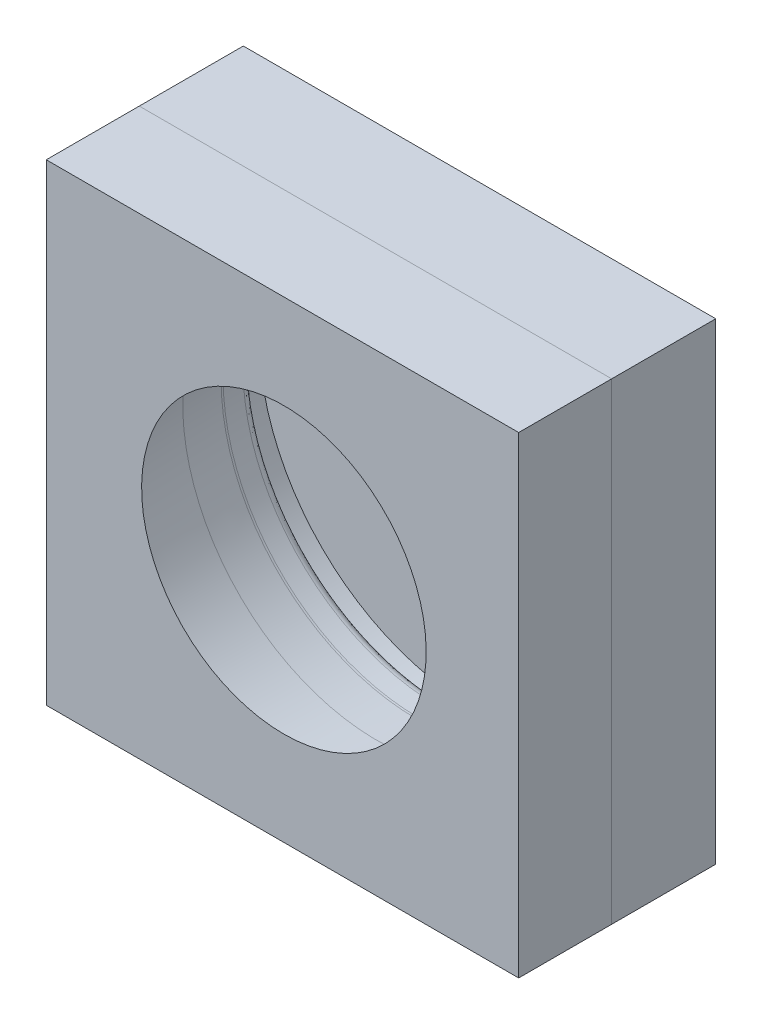
ISO-10303-21;
HEADER;
FILE_DESCRIPTION(('STEP AP214'),'2;1');
FILE_NAME('part.step','',(''),(''),'','','');
FILE_SCHEMA(('AUTOMOTIVE_DESIGN { 1 0 10303 214 1 1 1 1 }'));
ENDSEC;
DATA;
#1=APPLICATION_CONTEXT('core data for automotive mechanical design processes');
#2=APPLICATION_PROTOCOL_DEFINITION('international standard','automotive_design',2000,#1);
#3=PRODUCT_CONTEXT('',#1,'mechanical');
#4=PRODUCT('Part','Part','',(#3));
#5=PRODUCT_RELATED_PRODUCT_CATEGORY('part','',(#4));
#6=PRODUCT_DEFINITION_FORMATION('','',#4);
#7=PRODUCT_DEFINITION_CONTEXT('part definition',#1,'design');
#8=PRODUCT_DEFINITION('design','',#6,#7);
#9=PRODUCT_DEFINITION_SHAPE('','',#8);
#10=(LENGTH_UNIT() NAMED_UNIT(*) SI_UNIT(.MILLI.,.METRE.));
#11=(NAMED_UNIT(*) PLANE_ANGLE_UNIT() SI_UNIT($,.RADIAN.));
#12=(NAMED_UNIT(*) SI_UNIT($,.STERADIAN.) SOLID_ANGLE_UNIT());
#13=UNCERTAINTY_MEASURE_WITH_UNIT(LENGTH_MEASURE(1.E-05),#10,'distance_accuracy_value','');
#14=(GEOMETRIC_REPRESENTATION_CONTEXT(3) GLOBAL_UNCERTAINTY_ASSIGNED_CONTEXT((#13)) GLOBAL_UNIT_ASSIGNED_CONTEXT((#10,
#11,#12)) REPRESENTATION_CONTEXT('',''));
#15=CARTESIAN_POINT('',(0.,0.,0.));
#16=DIRECTION('',(0.,0.,1.));
#17=DIRECTION('',(1.,0.,0.));
#18=AXIS2_PLACEMENT_3D('',#15,#16,#17);
#19=CARTESIAN_POINT('',(0.,-2.43573640629004E-13,67.1329433698925));
#20=DIRECTION('',(0.,0.,1.));
#21=DIRECTION('',(1.,0.,0.));
#22=AXIS2_PLACEMENT_3D('',#19,#20,#21);
#23=PLANE('',#22);
#24=DIRECTION('',(0.,-1.,0.));
#25=VECTOR('',#24,1.);
#26=CARTESIAN_POINT('',(-152.4,152.4,67.1329433698925));
#27=LINE('',#26,#25);
#28=CARTESIAN_POINT('',(-152.4,152.4,67.1329433698925));
#29=VERTEX_POINT('',#28);
#30=CARTESIAN_POINT('',(-152.4,-152.4,67.1329433698925));
#31=VERTEX_POINT('',#30);
#32=EDGE_CURVE('E99',#29,#31,#27,.T.);
#33=ORIENTED_EDGE('',*,*,#32,.T.);
#34=DIRECTION('',(1.,0.,0.));
#35=VECTOR('',#34,1.);
#36=CARTESIAN_POINT('',(152.4,-152.4,67.1329433698925));
#37=LINE('',#36,#35);
#38=CARTESIAN_POINT('',(152.4,-152.4,67.1329433698925));
#39=VERTEX_POINT('',#38);
#40=EDGE_CURVE('E201',#31,#39,#37,.T.);
#41=ORIENTED_EDGE('',*,*,#40,.T.);
#42=DIRECTION('',(0.,1.,0.));
#43=VECTOR('',#42,1.);
#44=CARTESIAN_POINT('',(152.4,152.4,67.1329433698925));
#45=LINE('',#44,#43);
#46=CARTESIAN_POINT('',(152.4,152.4,67.1329433698925));
#47=VERTEX_POINT('',#46);
#48=EDGE_CURVE('E103',#39,#47,#45,.T.);
#49=ORIENTED_EDGE('',*,*,#48,.T.);
#50=DIRECTION('',(-1.,0.,0.));
#51=VECTOR('',#50,1.);
#52=CARTESIAN_POINT('',(152.4,152.4,67.1329433698925));
#53=LINE('',#52,#51);
#54=EDGE_CURVE('E91',#47,#29,#53,.T.);
#55=ORIENTED_EDGE('',*,*,#54,.T.);
#56=EDGE_LOOP('',(#33,#41,#49,#55));
#57=FACE_BOUND('',#56,.T.);
#58=CARTESIAN_POINT('',(0.908695261639877,-0.0776127525779172,67.1329433698925));
#59=DIRECTION('',(0.,0.,1.));
#60=DIRECTION('',(1.,0.,0.));
#61=AXIS2_PLACEMENT_3D('',#58,#59,#60);
#62=CIRCLE('',#61,125.28603319766);
#63=CARTESIAN_POINT('',(126.1947284593,-0.0776127525779172,67.1329433698925));
#64=VERTEX_POINT('',#63);
#65=EDGE_CURVE('E111',#64,#64,#62,.T.);
#66=ORIENTED_EDGE('',*,*,#65,.F.);
#67=EDGE_LOOP('',(#66));
#68=FACE_BOUND('',#67,.T.);
#69=ADVANCED_FACE('F45',(#57,#68),#23,.T.);
#70=CARTESIAN_POINT('',(152.4,-152.4,228.6));
#71=DIRECTION('',(0.,1.,0.));
#72=DIRECTION('',(-1.,0.,0.));
#73=AXIS2_PLACEMENT_3D('',#70,#71,#72);
#74=PLANE('',#73);
#75=ORIENTED_EDGE('',*,*,#40,.F.);
#76=DIRECTION('',(0.,0.,-1.));
#77=VECTOR('',#76,1.);
#78=CARTESIAN_POINT('',(-152.4,-152.4,228.6));
#79=LINE('',#78,#77);
#80=CARTESIAN_POINT('',(-152.4,-152.4,0.));
#81=VERTEX_POINT('',#80);
#82=EDGE_CURVE('E62',#31,#81,#79,.T.);
#83=ORIENTED_EDGE('',*,*,#82,.T.);
#84=DIRECTION('',(1.,0.,0.));
#85=VECTOR('',#84,1.);
#86=CARTESIAN_POINT('',(152.4,-152.4,0.));
#87=LINE('',#86,#85);
#88=CARTESIAN_POINT('',(152.4,-152.4,0.));
#89=VERTEX_POINT('',#88);
#90=EDGE_CURVE('E116',#81,#89,#87,.T.);
#91=ORIENTED_EDGE('',*,*,#90,.T.);
#92=DIRECTION('',(0.,0.,-1.));
#93=VECTOR('',#92,1.);
#94=CARTESIAN_POINT('',(152.4,-152.4,228.6));
#95=LINE('',#94,#93);
#96=EDGE_CURVE('E70',#39,#89,#95,.T.);
#97=ORIENTED_EDGE('',*,*,#96,.F.);
#98=EDGE_LOOP('',(#75,#83,#91,#97));
#99=FACE_BOUND('',#98,.T.);
#100=ADVANCED_FACE('F172',(#99),#74,.F.);
#101=CARTESIAN_POINT('',(-152.4,152.4,228.6));
#102=DIRECTION('',(1.,0.,0.));
#103=DIRECTION('',(0.,1.,0.));
#104=AXIS2_PLACEMENT_3D('',#101,#102,#103);
#105=PLANE('',#104);
#106=ORIENTED_EDGE('',*,*,#32,.F.);
#107=DIRECTION('',(0.,0.,-1.));
#108=VECTOR('',#107,1.);
#109=CARTESIAN_POINT('',(-152.4,152.4,228.6));
#110=LINE('',#109,#108);
#111=CARTESIAN_POINT('',(-152.4,152.4,0.));
#112=VERTEX_POINT('',#111);
#113=EDGE_CURVE('E49',#29,#112,#110,.T.);
#114=ORIENTED_EDGE('',*,*,#113,.T.);
#115=DIRECTION('',(0.,-1.,0.));
#116=VECTOR('',#115,1.);
#117=CARTESIAN_POINT('',(-152.4,152.4,0.));
#118=LINE('',#117,#116);
#119=EDGE_CURVE('E119',#112,#81,#118,.T.);
#120=ORIENTED_EDGE('',*,*,#119,.T.);
#121=ORIENTED_EDGE('',*,*,#82,.F.);
#122=EDGE_LOOP('',(#106,#114,#120,#121));
#123=FACE_BOUND('',#122,.T.);
#124=ADVANCED_FACE('F100',(#123),#105,.F.);
#125=CARTESIAN_POINT('',(0.,0.,0.));
#126=DIRECTION('',(0.,0.,-1.));
#127=DIRECTION('',(-1.,0.,0.));
#128=AXIS2_PLACEMENT_3D('',#125,#126,#127);
#129=PLANE('',#128);
#130=ORIENTED_EDGE('',*,*,#119,.F.);
#131=DIRECTION('',(-1.,0.,0.));
#132=VECTOR('',#131,1.);
#133=CARTESIAN_POINT('',(152.4,152.4,0.));
#134=LINE('',#133,#132);
#135=CARTESIAN_POINT('',(152.4,152.4,0.));
#136=VERTEX_POINT('',#135);
#137=EDGE_CURVE('E93',#136,#112,#134,.T.);
#138=ORIENTED_EDGE('',*,*,#137,.F.);
#139=DIRECTION('',(0.,1.,0.));
#140=VECTOR('',#139,1.);
#141=CARTESIAN_POINT('',(152.4,152.4,0.));
#142=LINE('',#141,#140);
#143=EDGE_CURVE('E113',#89,#136,#142,.T.);
#144=ORIENTED_EDGE('',*,*,#143,.F.);
#145=ORIENTED_EDGE('',*,*,#90,.F.);
#146=EDGE_LOOP('',(#130,#138,#144,#145));
#147=FACE_BOUND('',#146,.T.);
#148=ADVANCED_FACE('F118',(#147),#129,.T.);
#149=CARTESIAN_POINT('',(152.4,152.4,228.6));
#150=DIRECTION('',(-1.,0.,0.));
#151=DIRECTION('',(0.,-1.,0.));
#152=AXIS2_PLACEMENT_3D('',#149,#150,#151);
#153=PLANE('',#152);
#154=ORIENTED_EDGE('',*,*,#48,.F.);
#155=ORIENTED_EDGE('',*,*,#96,.T.);
#156=ORIENTED_EDGE('',*,*,#143,.T.);
#157=DIRECTION('',(0.,0.,-1.));
#158=VECTOR('',#157,1.);
#159=CARTESIAN_POINT('',(152.4,152.4,228.6));
#160=LINE('',#159,#158);
#161=EDGE_CURVE('E97',#47,#136,#160,.T.);
#162=ORIENTED_EDGE('',*,*,#161,.F.);
#163=EDGE_LOOP('',(#154,#155,#156,#162));
#164=FACE_BOUND('',#163,.T.);
#165=ADVANCED_FACE('F114',(#164),#153,.F.);
#166=CARTESIAN_POINT('',(152.4,152.4,228.6));
#167=DIRECTION('',(0.,-1.,0.));
#168=DIRECTION('',(1.,0.,0.));
#169=AXIS2_PLACEMENT_3D('',#166,#167,#168);
#170=PLANE('',#169);
#171=ORIENTED_EDGE('',*,*,#54,.F.);
#172=ORIENTED_EDGE('',*,*,#161,.T.);
#173=ORIENTED_EDGE('',*,*,#137,.T.);
#174=ORIENTED_EDGE('',*,*,#113,.F.);
#175=EDGE_LOOP('',(#171,#172,#173,#174));
#176=FACE_BOUND('',#175,.T.);
#177=ADVANCED_FACE('F47',(#176),#170,.F.);
#178=CARTESIAN_POINT('',(0.90869526163995,-0.0776127525779172,41.3463400319306));
#179=DIRECTION('',(0.,0.,-1.));
#180=DIRECTION('',(0.,1.,0.));
#181=AXIS2_PLACEMENT_3D('',#178,#179,#180);
#182=CONICAL_SURFACE('',#181,126.276654574374,0.0383972435438753);
#183=CARTESIAN_POINT('',(0.90869526163995,-0.0776127525779172,41.3463400319306));
#184=DIRECTION('',(0.,0.,1.));
#185=DIRECTION('',(0.,-1.,0.));
#186=AXIS2_PLACEMENT_3D('',#183,#184,#185);
#187=CIRCLE('',#186,126.276654574374);
#188=CARTESIAN_POINT('',(0.90869526163995,-126.354267326952,41.3463400319301));
#189=VERTEX_POINT('',#188);
#190=EDGE_CURVE('E124',#189,#189,#187,.T.);
#191=ORIENTED_EDGE('',*,*,#190,.F.);
#192=EDGE_LOOP('',(#191));
#193=FACE_BOUND('',#192,.T.);
#194=ORIENTED_EDGE('',*,*,#65,.T.);
#195=EDGE_LOOP('',(#194));
#196=FACE_BOUND('',#195,.T.);
#197=ADVANCED_FACE('F169',(#193,#196),#182,.F.);
#198=CARTESIAN_POINT('',(0.90869526163995,-0.0776127525779125,40.0027667138672));
#199=DIRECTION('',(0.,0.,1.));
#200=DIRECTION('',(0.,-1.,0.));
#201=AXIS2_PLACEMENT_3D('',#198,#199,#200);
#202=TOROIDAL_SURFACE('',#201,91.302452500002,35.);
#203=ORIENTED_EDGE('',*,*,#190,.T.);
#204=EDGE_LOOP('',(#203));
#205=FACE_BOUND('',#204,.T.);
#206=CARTESIAN_POINT('',(0.90869526163995,-0.0776127525779125,40.0027667138671));
#207=DIRECTION('',(0.,0.,1.));
#208=DIRECTION('',(0.,-1.,0.));
#209=AXIS2_PLACEMENT_3D('',#206,#207,#208);
#210=CIRCLE('',#209,126.302452500002);
#211=CARTESIAN_POINT('',(0.90869526163995,-126.38006525258,40.0027667138667));
#212=VERTEX_POINT('',#211);
#213=EDGE_CURVE('E127',#212,#212,#210,.T.);
#214=ORIENTED_EDGE('',*,*,#213,.F.);
#215=EDGE_LOOP('',(#214));
#216=FACE_BOUND('',#215,.T.);
#217=ADVANCED_FACE('F173',(#205,#216),#202,.F.);
#218=CARTESIAN_POINT('',(0.90869526163995,-0.0776127525783632,169.085651996013));
#219=DIRECTION('',(0.,0.,1.));
#220=DIRECTION('',(0.,-1.,0.));
#221=AXIS2_PLACEMENT_3D('',#218,#219,#220);
#222=CYLINDRICAL_SURFACE('',#221,126.302452500002);
#223=CARTESIAN_POINT('',(0.90869526163995,-0.0776127525778679,27.2484054174911));
#224=DIRECTION('',(0.,0.,1.));
#225=DIRECTION('',(0.,-1.,0.));
#226=AXIS2_PLACEMENT_3D('',#223,#224,#225);
#227=CIRCLE('',#226,126.302452500002);
#228=CARTESIAN_POINT('',(0.90869526163995,-126.38006525258,27.2484054174907));
#229=VERTEX_POINT('',#228);
#230=EDGE_CURVE('E130',#229,#229,#227,.T.);
#231=ORIENTED_EDGE('',*,*,#230,.F.);
#232=EDGE_LOOP('',(#231));
#233=FACE_BOUND('',#232,.T.);
#234=ORIENTED_EDGE('',*,*,#213,.T.);
#235=EDGE_LOOP('',(#234));
#236=FACE_BOUND('',#235,.T.);
#237=ADVANCED_FACE('F155',(#233,#236),#222,.F.);
#238=CARTESIAN_POINT('',(0.90869526163995,-133.59734825258,20.9609433698914));
#239=CARTESIAN_POINT('',(0.90869526163995,-128.912310640584,20.2965209052261));
#240=CARTESIAN_POINT('',(0.90869526163995,-126.38006525258,23.7261671924004));
#241=CARTESIAN_POINT('',(0.90869526163995,-126.38006525258,27.2484054174907));
#242=(BOUNDED_CURVE() B_SPLINE_CURVE(3,(#238,#239,#240,#241),.UNSPECIFIED.,.F.,
.F.) B_SPLINE_CURVE_WITH_KNOTS((4,4),(0.,1.),
.UNSPECIFIED.) CURVE() GEOMETRIC_REPRESENTATION_ITEM() RATIONAL_B_SPLINE_CURVE((0.255591691964593,
0.242825015050018,0.327183181081988,0.508666190060503)) REPRESENTATION_ITEM(''));
#243=CARTESIAN_POINT('',(0.90869526163995,-0.0776127525783632,169.085651996013));
#244=DIRECTION('',(0.,0.,1.));
#245=AXIS1_PLACEMENT('',#243,#244);
#246=SURFACE_OF_REVOLUTION('',#242,#245);
#247=ORIENTED_EDGE('',*,*,#230,.T.);
#248=EDGE_LOOP('',(#247));
#249=FACE_BOUND('',#248,.T.);
#250=CARTESIAN_POINT('',(0.90869526163995,-0.077612752577846,20.9609433698918));
#251=DIRECTION('',(0.,0.,1.));
#252=DIRECTION('',(0.,-1.,0.));
#253=AXIS2_PLACEMENT_3D('',#250,#251,#252);
#254=CIRCLE('',#253,133.519735500002);
#255=CARTESIAN_POINT('',(0.90869526163995,-133.59734825258,20.9609433698914));
#256=VERTEX_POINT('',#255);
#257=EDGE_CURVE('E133',#256,#256,#254,.T.);
#258=ORIENTED_EDGE('',*,*,#257,.F.);
#259=EDGE_LOOP('',(#258));
#260=FACE_BOUND('',#259,.T.);
#261=ADVANCED_FACE('F150',(#249,#260),#246,.F.);
#262=CARTESIAN_POINT('',(0.90869526163995,-133.59734825258,20.9609433698914));
#263=CARTESIAN_POINT('',(0.90869526163995,-136.783173828737,21.4127506458637));
#264=CARTESIAN_POINT('',(0.90869526163995,-138.50510069258,19.0805911705852));
#265=CARTESIAN_POINT('',(0.90869526163995,-138.50510069258,16.685469177524));
#266=(BOUNDED_CURVE() B_SPLINE_CURVE(3,(#262,#263,#264,#265),.UNSPECIFIED.,.F.,
.F.) B_SPLINE_CURVE_WITH_KNOTS((4,4),(0.,1.),
.UNSPECIFIED.) CURVE() GEOMETRIC_REPRESENTATION_ITEM() RATIONAL_B_SPLINE_CURVE((0.255591691964592,
0.242825015050017,0.327183181081988,0.508666190060503)) REPRESENTATION_ITEM(''));
#267=CARTESIAN_POINT('',(0.90869526163995,-0.0776127525783632,169.085651996013));
#268=DIRECTION('',(0.,0.,1.));
#269=AXIS1_PLACEMENT('',#267,#268);
#270=SURFACE_OF_REVOLUTION('',#266,#269);
#271=CARTESIAN_POINT('',(0.90869526163995,-0.0776127525778311,16.6854691775245));
#272=DIRECTION('',(0.,0.,1.));
#273=DIRECTION('',(0.,-1.,0.));
#274=AXIS2_PLACEMENT_3D('',#271,#272,#273);
#275=CIRCLE('',#274,138.427487940002);
#276=CARTESIAN_POINT('',(0.90869526163995,-138.50510069258,16.685469177524));
#277=VERTEX_POINT('',#276);
#278=EDGE_CURVE('E54',#277,#277,#275,.T.);
#279=ORIENTED_EDGE('',*,*,#278,.F.);
#280=EDGE_LOOP('',(#279));
#281=FACE_BOUND('',#280,.T.);
#282=ORIENTED_EDGE('',*,*,#257,.T.);
#283=EDGE_LOOP('',(#282));
#284=FACE_BOUND('',#283,.T.);
#285=ADVANCED_FACE('F154',(#281,#284),#270,.T.);
#286=CARTESIAN_POINT('',(0.90869526163995,-0.0776127525783632,169.085651996013));
#287=DIRECTION('',(0.,0.,1.));
#288=DIRECTION('',(0.,-1.,0.));
#289=AXIS2_PLACEMENT_3D('',#286,#287,#288);
#290=CYLINDRICAL_SURFACE('',#289,138.427487940002);
#291=CARTESIAN_POINT('',(0.90869526163995,-0.0776127525777892,4.68546917752451));
#292=DIRECTION('',(0.,0.,1.));
#293=DIRECTION('',(0.,-1.,0.));
#294=AXIS2_PLACEMENT_3D('',#291,#292,#293);
#295=CIRCLE('',#294,138.427487940002);
#296=CARTESIAN_POINT('',(0.90869526163995,-138.50510069258,4.68546917752402));
#297=VERTEX_POINT('',#296);
#298=EDGE_CURVE('E12',#297,#297,#295,.T.);
#299=ORIENTED_EDGE('',*,*,#298,.F.);
#300=EDGE_LOOP('',(#299));
#301=FACE_BOUND('',#300,.T.);
#302=ORIENTED_EDGE('',*,*,#278,.T.);
#303=EDGE_LOOP('',(#302));
#304=FACE_BOUND('',#303,.T.);
#305=ADVANCED_FACE('F160',(#301,#304),#290,.F.);
#306=CARTESIAN_POINT('',(0.90869526163995,-138.50510069258,4.68546917752402));
#307=DIRECTION('',(0.,0.,-1.));
#308=DIRECTION('',(0.,1.,0.));
#309=AXIS2_PLACEMENT_3D('',#306,#307,#308);
#310=PLANE('',#309);
#311=ORIENTED_EDGE('',*,*,#298,.T.);
#312=EDGE_LOOP('',(#311));
#313=FACE_BOUND('',#312,.T.);
#314=ADVANCED_FACE('F164',(#313),#310,.F.);
#315=CLOSED_SHELL('',(#69,#100,#124,#148,#165,#177,#197,#217,#237,#261,#285,#305,#314));
#316=MANIFOLD_SOLID_BREP('B2',#315);
#317=CARTESIAN_POINT('',(0.,-2.43573640629004E-13,67.1329433698925));
#318=DIRECTION('',(0.,0.,1.));
#319=DIRECTION('',(1.,0.,0.));
#320=AXIS2_PLACEMENT_3D('',#317,#318,#319);
#321=PLANE('',#320);
#322=CARTESIAN_POINT('',(0.908695261639877,-0.0776127525779172,67.1329433698925));
#323=DIRECTION('',(0.,0.,1.));
#324=DIRECTION('',(1.,0.,0.));
#325=AXIS2_PLACEMENT_3D('',#322,#323,#324);
#326=CIRCLE('',#325,125.28603319766);
#327=CARTESIAN_POINT('',(126.1947284593,-0.0776127525779172,67.1329433698925));
#328=VERTEX_POINT('',#327);
#329=EDGE_CURVE('E43',#328,#328,#326,.T.);
#330=ORIENTED_EDGE('',*,*,#329,.T.);
#331=EDGE_LOOP('',(#330));
#332=FACE_BOUND('',#331,.T.);
#333=DIRECTION('',(0.,-1.,0.));
#334=VECTOR('',#333,1.);
#335=CARTESIAN_POINT('',(-152.4,152.4,67.1329433698925));
#336=LINE('',#335,#334);
#337=CARTESIAN_POINT('',(-152.4,152.4,67.1329433698925));
#338=VERTEX_POINT('',#337);
#339=CARTESIAN_POINT('',(-152.4,-152.4,67.1329433698925));
#340=VERTEX_POINT('',#339);
#341=EDGE_CURVE('E368',#338,#340,#336,.T.);
#342=ORIENTED_EDGE('',*,*,#341,.F.);
#343=DIRECTION('',(-1.,0.,0.));
#344=VECTOR('',#343,1.);
#345=CARTESIAN_POINT('',(152.4,152.4,67.1329433698925));
#346=LINE('',#345,#344);
#347=CARTESIAN_POINT('',(152.4,152.4,67.1329433698925));
#348=VERTEX_POINT('',#347);
#349=EDGE_CURVE('E339',#348,#338,#346,.T.);
#350=ORIENTED_EDGE('',*,*,#349,.F.);
#351=DIRECTION('',(0.,1.,0.));
#352=VECTOR('',#351,1.);
#353=CARTESIAN_POINT('',(152.4,152.4,67.1329433698925));
#354=LINE('',#353,#352);
#355=CARTESIAN_POINT('',(152.4,-152.4,67.1329433698925));
#356=VERTEX_POINT('',#355);
#357=EDGE_CURVE('E370',#356,#348,#354,.T.);
#358=ORIENTED_EDGE('',*,*,#357,.F.);
#359=DIRECTION('',(1.,0.,0.));
#360=VECTOR('',#359,1.);
#361=CARTESIAN_POINT('',(152.4,-152.4,67.1329433698925));
#362=LINE('',#361,#360);
#363=EDGE_CURVE('E298',#340,#356,#362,.T.);
#364=ORIENTED_EDGE('',*,*,#363,.F.);
#365=EDGE_LOOP('',(#342,#350,#358,#364));
#366=FACE_BOUND('',#365,.T.);
#367=ADVANCED_FACE('F291',(#332,#366),#321,.F.);
#368=CARTESIAN_POINT('',(0.90869526163995,-0.077612752578179,116.353347557886));
#369=DIRECTION('',(0.,0.,-1.));
#370=DIRECTION('',(0.,1.,0.));
#371=AXIS2_PLACEMENT_3D('',#368,#369,#370);
#372=CONICAL_SURFACE('',#371,119.056955539065,1.13331210913777);
#373=CARTESIAN_POINT('',(0.90869526163995,-0.0776127525782104,125.348106712939));
#374=DIRECTION('',(0.,0.,1.));
#375=DIRECTION('',(0.,-1.,0.));
#376=AXIS2_PLACEMENT_3D('',#373,#374,#375);
#377=CIRCLE('',#376,99.8255002525088);
#378=CARTESIAN_POINT('',(0.90869526163995,-99.903113005087,125.348106712939));
#379=VERTEX_POINT('',#378);
#380=EDGE_CURVE('E358',#379,#379,#377,.T.);
#381=ORIENTED_EDGE('',*,*,#380,.T.);
#382=EDGE_LOOP('',(#381));
#383=FACE_BOUND('',#382,.T.);
#384=CARTESIAN_POINT('',(0.90869526163995,-0.077612752578179,116.353347557886));
#385=DIRECTION('',(0.,0.,1.));
#386=DIRECTION('',(0.,-1.,0.));
#387=AXIS2_PLACEMENT_3D('',#384,#385,#386);
#388=CIRCLE('',#387,119.056955539065);
#389=CARTESIAN_POINT('',(0.90869526163995,-119.134568291643,116.353347557886));
#390=VERTEX_POINT('',#389);
#391=EDGE_CURVE('E413',#390,#390,#388,.T.);
#392=ORIENTED_EDGE('',*,*,#391,.F.);
#393=EDGE_LOOP('',(#392));
#394=FACE_BOUND('',#393,.T.);
#395=ADVANCED_FACE('F388',(#383,#394),#372,.F.);
#396=CARTESIAN_POINT('',(0.90869526163995,-0.0776127525781537,109.10678459855));
#397=DIRECTION('',(0.,0.,1.));
#398=DIRECTION('',(0.,-1.,0.));
#399=AXIS2_PLACEMENT_3D('',#396,#397,#398);
#400=TOROIDAL_SURFACE('',#399,115.667659848753,8.);
#401=ORIENTED_EDGE('',*,*,#391,.T.);
#402=EDGE_LOOP('',(#401));
#403=FACE_BOUND('',#402,.T.);
#404=CARTESIAN_POINT('',(0.90869526163995,-0.0776127525781548,109.41388707125));
#405=DIRECTION('',(0.,0.,1.));
#406=DIRECTION('',(0.,-1.,0.));
#407=AXIS2_PLACEMENT_3D('',#404,#405,#406);
#408=CIRCLE('',#407,123.661763180038);
#409=CARTESIAN_POINT('',(0.90869526163995,-123.739375932616,109.413887071249));
#410=VERTEX_POINT('',#409);
#411=EDGE_CURVE('E407',#410,#410,#408,.T.);
#412=ORIENTED_EDGE('',*,*,#411,.F.);
#413=EDGE_LOOP('',(#412));
#414=FACE_BOUND('',#413,.T.);
#415=ADVANCED_FACE('F393',(#403,#414),#400,.F.);
#416=CARTESIAN_POINT('',(0.90869526163995,-0.0776127525779172,41.3463400319306));
#417=DIRECTION('',(0.,0.,-1.));
#418=DIRECTION('',(0.,1.,0.));
#419=AXIS2_PLACEMENT_3D('',#416,#417,#418);
#420=CONICAL_SURFACE('',#419,126.276654574374,0.0383972435438753);
#421=ORIENTED_EDGE('',*,*,#329,.F.);
#422=EDGE_LOOP('',(#421));
#423=FACE_BOUND('',#422,.T.);
#424=ORIENTED_EDGE('',*,*,#411,.T.);
#425=EDGE_LOOP('',(#424));
#426=FACE_BOUND('',#425,.T.);
#427=ADVANCED_FACE('F382',(#423,#426),#420,.F.);
#428=CARTESIAN_POINT('',(0.90869526163995,-91.876387752581,127.132943369892));
#429=CARTESIAN_POINT('',(0.90869526163995,-94.6834634015012,127.132943369892));
#430=CARTESIAN_POINT('',(0.90869526163995,-97.40004583746,126.518818236651));
#431=CARTESIAN_POINT('',(0.90869526163995,-99.903113005087,125.348106712939));
#432=(BOUNDED_CURVE() B_SPLINE_CURVE(3,(#428,#429,#430,#431),.UNSPECIFIED.,.F.,
.F.) B_SPLINE_CURVE_WITH_KNOTS((4,4),(0.,1.),
.UNSPECIFIED.) CURVE() GEOMETRIC_REPRESENTATION_ITEM() RATIONAL_B_SPLINE_CURVE((0.254333095030252,
0.254333095030252,0.258499793724843,0.266833191114025)) REPRESENTATION_ITEM(''));
#433=CARTESIAN_POINT('',(0.90869526163995,-0.0776127525783632,169.085651996013));
#434=DIRECTION('',(0.,0.,1.));
#435=AXIS1_PLACEMENT('',#433,#434);
#436=SURFACE_OF_REVOLUTION('',#432,#435);
#437=ORIENTED_EDGE('',*,*,#380,.F.);
#438=EDGE_LOOP('',(#437));
#439=FACE_BOUND('',#438,.T.);
#440=CARTESIAN_POINT('',(0.90869526163995,-0.0776127525782167,127.132943369893));
#441=DIRECTION('',(0.,0.,1.));
#442=DIRECTION('',(0.,-1.,0.));
#443=AXIS2_PLACEMENT_3D('',#440,#441,#442);
#444=CIRCLE('',#443,91.7987750000028);
#445=CARTESIAN_POINT('',(0.90869526163995,-91.876387752581,127.132943369892));
#446=VERTEX_POINT('',#445);
#447=EDGE_CURVE('E353',#446,#446,#444,.T.);
#448=ORIENTED_EDGE('',*,*,#447,.T.);
#449=EDGE_LOOP('',(#448));
#450=FACE_BOUND('',#449,.T.);
#451=ADVANCED_FACE('F375',(#439,#450),#436,.T.);
#452=CARTESIAN_POINT('',(152.4,-152.4,228.6));
#453=DIRECTION('',(0.,1.,0.));
#454=DIRECTION('',(-1.,0.,0.));
#455=AXIS2_PLACEMENT_3D('',#452,#453,#454);
#456=PLANE('',#455);
#457=DIRECTION('',(0.,0.,-1.));
#458=VECTOR('',#457,1.);
#459=CARTESIAN_POINT('',(-152.4,-152.4,228.6));
#460=LINE('',#459,#458);
#461=CARTESIAN_POINT('',(-152.4,-152.4,127.132943369892));
#462=VERTEX_POINT('',#461);
#463=EDGE_CURVE('E335',#462,#340,#460,.T.);
#464=ORIENTED_EDGE('',*,*,#463,.T.);
#465=ORIENTED_EDGE('',*,*,#363,.T.);
#466=DIRECTION('',(0.,0.,-1.));
#467=VECTOR('',#466,1.);
#468=CARTESIAN_POINT('',(152.4,-152.4,228.6));
#469=LINE('',#468,#467);
#470=CARTESIAN_POINT('',(152.4,-152.4,127.132943369893));
#471=VERTEX_POINT('',#470);
#472=EDGE_CURVE('E355',#471,#356,#469,.T.);
#473=ORIENTED_EDGE('',*,*,#472,.F.);
#474=DIRECTION('',(-1.,0.,0.));
#475=VECTOR('',#474,1.);
#476=CARTESIAN_POINT('',(152.4,-152.4,127.132943369892));
#477=LINE('',#476,#475);
#478=EDGE_CURVE('E340',#471,#462,#477,.T.);
#479=ORIENTED_EDGE('',*,*,#478,.T.);
#480=EDGE_LOOP('',(#464,#465,#473,#479));
#481=FACE_BOUND('',#480,.T.);
#482=ADVANCED_FACE('F373',(#481),#456,.F.);
#483=CARTESIAN_POINT('',(0.,-4.61267334725164E-13,127.132943369893));
#484=DIRECTION('',(0.,0.,-1.));
#485=DIRECTION('',(0.,1.,0.));
#486=AXIS2_PLACEMENT_3D('',#483,#484,#485);
#487=PLANE('',#486);
#488=ORIENTED_EDGE('',*,*,#447,.F.);
#489=EDGE_LOOP('',(#488));
#490=FACE_BOUND('',#489,.T.);
#491=ORIENTED_EDGE('',*,*,#478,.F.);
#492=DIRECTION('',(0.,-1.,0.));
#493=VECTOR('',#492,1.);
#494=CARTESIAN_POINT('',(152.4,152.4,127.132943369893));
#495=LINE('',#494,#493);
#496=CARTESIAN_POINT('',(152.4,152.4,127.132943369893));
#497=VERTEX_POINT('',#496);
#498=EDGE_CURVE('E345',#497,#471,#495,.T.);
#499=ORIENTED_EDGE('',*,*,#498,.F.);
#500=DIRECTION('',(1.,0.,0.));
#501=VECTOR('',#500,1.);
#502=CARTESIAN_POINT('',(152.4,152.4,127.132943369893));
#503=LINE('',#502,#501);
#504=CARTESIAN_POINT('',(-152.4,152.4,127.132943369893));
#505=VERTEX_POINT('',#504);
#506=EDGE_CURVE('E343',#505,#497,#503,.T.);
#507=ORIENTED_EDGE('',*,*,#506,.F.);
#508=DIRECTION('',(0.,1.,0.));
#509=VECTOR('',#508,1.);
#510=CARTESIAN_POINT('',(-152.4,152.4,127.132943369893));
#511=LINE('',#510,#509);
#512=EDGE_CURVE('E330',#462,#505,#511,.T.);
#513=ORIENTED_EDGE('',*,*,#512,.F.);
#514=EDGE_LOOP('',(#491,#499,#507,#513));
#515=FACE_BOUND('',#514,.T.);
#516=ADVANCED_FACE('F344',(#490,#515),#487,.F.);
#517=CARTESIAN_POINT('',(-152.4,152.4,228.6));
#518=DIRECTION('',(1.,0.,0.));
#519=DIRECTION('',(0.,1.,0.));
#520=AXIS2_PLACEMENT_3D('',#517,#518,#519);
#521=PLANE('',#520);
#522=DIRECTION('',(0.,0.,-1.));
#523=VECTOR('',#522,1.);
#524=CARTESIAN_POINT('',(-152.4,152.4,228.6));
#525=LINE('',#524,#523);
#526=EDGE_CURVE('E334',#505,#338,#525,.T.);
#527=ORIENTED_EDGE('',*,*,#526,.T.);
#528=ORIENTED_EDGE('',*,*,#341,.T.);
#529=ORIENTED_EDGE('',*,*,#463,.F.);
#530=ORIENTED_EDGE('',*,*,#512,.T.);
#531=EDGE_LOOP('',(#527,#528,#529,#530));
#532=FACE_BOUND('',#531,.T.);
#533=ADVANCED_FACE('F332',(#532),#521,.F.);
#534=CARTESIAN_POINT('',(152.4,152.4,228.6));
#535=DIRECTION('',(-1.,0.,0.));
#536=DIRECTION('',(0.,-1.,0.));
#537=AXIS2_PLACEMENT_3D('',#534,#535,#536);
#538=PLANE('',#537);
#539=ORIENTED_EDGE('',*,*,#472,.T.);
#540=ORIENTED_EDGE('',*,*,#357,.T.);
#541=DIRECTION('',(0.,0.,-1.));
#542=VECTOR('',#541,1.);
#543=CARTESIAN_POINT('',(152.4,152.4,228.6));
#544=LINE('',#543,#542);
#545=EDGE_CURVE('E352',#497,#348,#544,.T.);
#546=ORIENTED_EDGE('',*,*,#545,.F.);
#547=ORIENTED_EDGE('',*,*,#498,.T.);
#548=EDGE_LOOP('',(#539,#540,#546,#547));
#549=FACE_BOUND('',#548,.T.);
#550=ADVANCED_FACE('F372',(#549),#538,.F.);
#551=CARTESIAN_POINT('',(152.4,152.4,228.6));
#552=DIRECTION('',(0.,-1.,0.));
#553=DIRECTION('',(1.,0.,0.));
#554=AXIS2_PLACEMENT_3D('',#551,#552,#553);
#555=PLANE('',#554);
#556=ORIENTED_EDGE('',*,*,#545,.T.);
#557=ORIENTED_EDGE('',*,*,#349,.T.);
#558=ORIENTED_EDGE('',*,*,#526,.F.);
#559=ORIENTED_EDGE('',*,*,#506,.T.);
#560=EDGE_LOOP('',(#556,#557,#558,#559));
#561=FACE_BOUND('',#560,.T.);
#562=ADVANCED_FACE('F350',(#561),#555,.F.);
#563=CLOSED_SHELL('',(#367,#395,#415,#427,#451,#482,#516,#533,#550,#562));
#564=MANIFOLD_SOLID_BREP('B6',#563);
#565=ADVANCED_BREP_SHAPE_REPRESENTATION('',(#18,#316,#564),#14);
#566=SHAPE_DEFINITION_REPRESENTATION(#9,#565);
ENDSEC;
END-ISO-10303-21;
